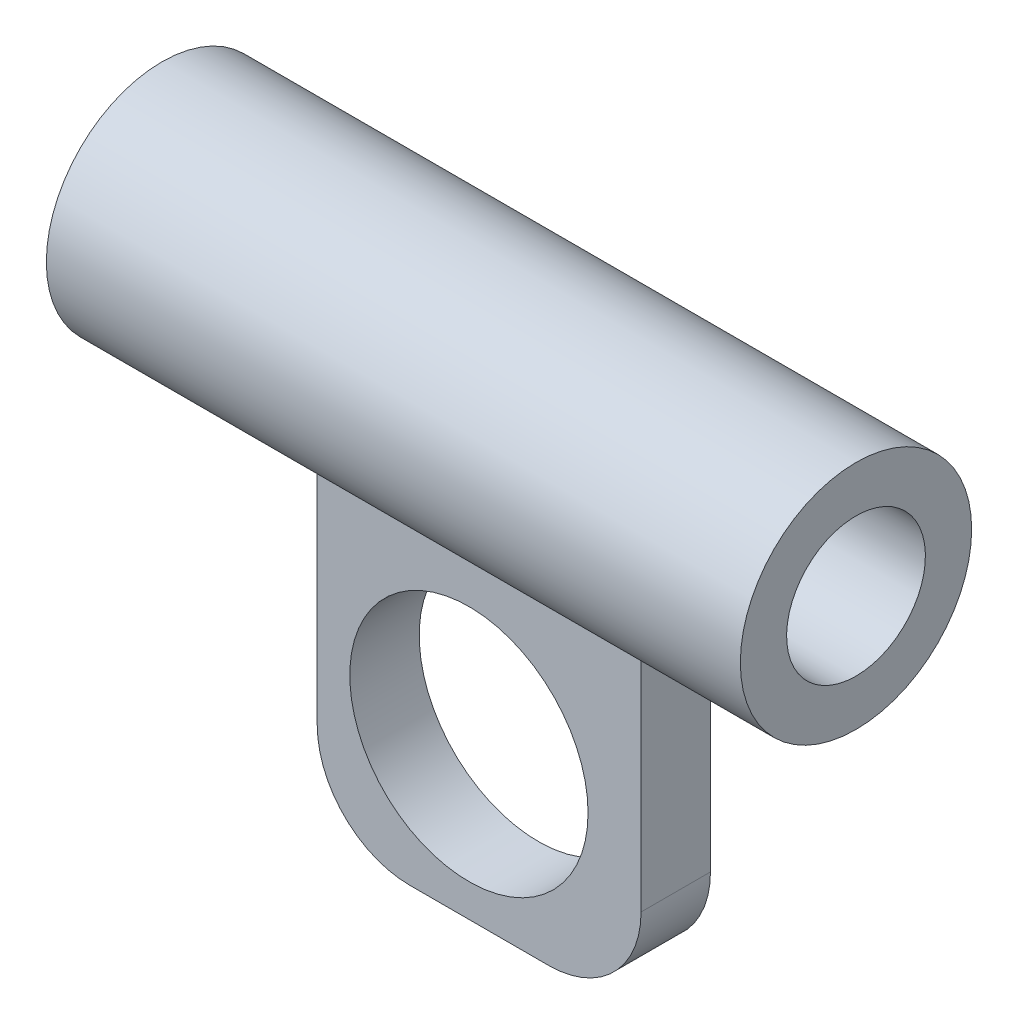
ISO-10303-21;
HEADER;
FILE_DESCRIPTION(('STEP AP214'),'2;1');
FILE_NAME('part.step','',(''),(''),'','','');
FILE_SCHEMA(('AUTOMOTIVE_DESIGN { 1 0 10303 214 1 1 1 1 }'));
ENDSEC;
DATA;
#1=APPLICATION_CONTEXT('core data for automotive mechanical design processes');
#2=APPLICATION_PROTOCOL_DEFINITION('international standard','automotive_design',2000,#1);
#3=PRODUCT_CONTEXT('',#1,'mechanical');
#4=PRODUCT('Part','Part','',(#3));
#5=PRODUCT_RELATED_PRODUCT_CATEGORY('part','',(#4));
#6=PRODUCT_DEFINITION_FORMATION('','',#4);
#7=PRODUCT_DEFINITION_CONTEXT('part definition',#1,'design');
#8=PRODUCT_DEFINITION('design','',#6,#7);
#9=PRODUCT_DEFINITION_SHAPE('','',#8);
#10=(LENGTH_UNIT() NAMED_UNIT(*) SI_UNIT(.MILLI.,.METRE.));
#11=(NAMED_UNIT(*) PLANE_ANGLE_UNIT() SI_UNIT($,.RADIAN.));
#12=(NAMED_UNIT(*) SI_UNIT($,.STERADIAN.) SOLID_ANGLE_UNIT());
#13=UNCERTAINTY_MEASURE_WITH_UNIT(LENGTH_MEASURE(1.E-05),#10,'distance_accuracy_value','');
#14=(GEOMETRIC_REPRESENTATION_CONTEXT(3) GLOBAL_UNCERTAINTY_ASSIGNED_CONTEXT((#13)) GLOBAL_UNIT_ASSIGNED_CONTEXT((#10,
#11,#12)) REPRESENTATION_CONTEXT('',''));
#15=CARTESIAN_POINT('',(0.,0.,0.));
#16=DIRECTION('',(0.,0.,1.));
#17=DIRECTION('',(1.,0.,0.));
#18=AXIS2_PLACEMENT_3D('',#15,#16,#17);
#19=CARTESIAN_POINT('',(4.,4.,3.));
#20=DIRECTION('',(0.,0.,-1.));
#21=DIRECTION('',(-1.,0.,0.));
#22=AXIS2_PLACEMENT_3D('',#19,#20,#21);
#23=PLANE('',#22);
#24=DIRECTION('',(0.,1.,0.));
#25=VECTOR('',#24,1.);
#26=CARTESIAN_POINT('',(14.,4.00000000000003,3.));
#27=LINE('',#26,#25);
#28=CARTESIAN_POINT('',(14.,4.,3.));
#29=VERTEX_POINT('',#28);
#30=CARTESIAN_POINT('',(14.,14.3540870917137,3.));
#31=VERTEX_POINT('',#30);
#32=EDGE_CURVE('E100',#29,#31,#27,.T.);
#33=ORIENTED_EDGE('',*,*,#32,.T.);
#34=DIRECTION('',(-1.,0.,0.));
#35=VECTOR('',#34,1.);
#36=CARTESIAN_POINT('',(22.,14.3540870917137,3.));
#37=LINE('',#36,#35);
#38=CARTESIAN_POINT('',(0.,14.3540870917137,3.));
#39=VERTEX_POINT('',#38);
#40=EDGE_CURVE('E95',#31,#39,#37,.T.);
#41=ORIENTED_EDGE('',*,*,#40,.T.);
#42=DIRECTION('',(0.,-1.,0.));
#43=VECTOR('',#42,1.);
#44=CARTESIAN_POINT('',(0.,4.00000000000003,3.));
#45=LINE('',#44,#43);
#46=CARTESIAN_POINT('',(0.,4.00000000000003,3.));
#47=VERTEX_POINT('',#46);
#48=EDGE_CURVE('E58',#39,#47,#45,.T.);
#49=ORIENTED_EDGE('',*,*,#48,.T.);
#50=CARTESIAN_POINT('',(4.,4.,3.));
#51=DIRECTION('',(0.,0.,1.));
#52=DIRECTION('',(-1.,0.,0.));
#53=AXIS2_PLACEMENT_3D('',#50,#51,#52);
#54=CIRCLE('',#53,4.);
#55=CARTESIAN_POINT('',(4.00000000000003,0.,3.));
#56=VERTEX_POINT('',#55);
#57=EDGE_CURVE('E124',#47,#56,#54,.T.);
#58=ORIENTED_EDGE('',*,*,#57,.T.);
#59=DIRECTION('',(1.,0.,0.));
#60=VECTOR('',#59,1.);
#61=CARTESIAN_POINT('',(4.00000000000003,0.,3.));
#62=LINE('',#61,#60);
#63=CARTESIAN_POINT('',(9.99999999999997,0.,3.));
#64=VERTEX_POINT('',#63);
#65=EDGE_CURVE('E87',#56,#64,#62,.T.);
#66=ORIENTED_EDGE('',*,*,#65,.T.);
#67=CARTESIAN_POINT('',(10.,4.,3.));
#68=DIRECTION('',(0.,0.,1.));
#69=DIRECTION('',(1.,0.,0.));
#70=AXIS2_PLACEMENT_3D('',#67,#68,#69);
#71=CIRCLE('',#70,4.);
#72=EDGE_CURVE('E109',#64,#29,#71,.T.);
#73=ORIENTED_EDGE('',*,*,#72,.T.);
#74=EDGE_LOOP('',(#33,#41,#49,#58,#66,#73));
#75=FACE_BOUND('',#74,.T.);
#76=CARTESIAN_POINT('',(6.55801035100123,6.56601198515732,3.));
#77=DIRECTION('',(0.,0.,1.));
#78=DIRECTION('',(1.,0.,0.));
#79=AXIS2_PLACEMENT_3D('',#76,#77,#78);
#80=CIRCLE('',#79,5.15);
#81=CARTESIAN_POINT('',(11.7080103510012,6.56601198515732,3.));
#82=VERTEX_POINT('',#81);
#83=EDGE_CURVE('E117',#82,#82,#80,.T.);
#84=ORIENTED_EDGE('',*,*,#83,.F.);
#85=EDGE_LOOP('',(#84));
#86=FACE_BOUND('',#85,.T.);
#87=ADVANCED_FACE('F35',(#75,#86),#23,.F.);
#88=CARTESIAN_POINT('',(4.,4.,0.));
#89=DIRECTION('',(0.,0.,-1.));
#90=DIRECTION('',(-1.,0.,0.));
#91=AXIS2_PLACEMENT_3D('',#88,#89,#90);
#92=PLANE('',#91);
#93=DIRECTION('',(-1.,0.,0.));
#94=VECTOR('',#93,1.);
#95=CARTESIAN_POINT('',(22.,14.4860551808923,0.));
#96=LINE('',#95,#94);
#97=CARTESIAN_POINT('',(14.,14.4860551808923,0.));
#98=VERTEX_POINT('',#97);
#99=CARTESIAN_POINT('',(0.,14.4860551808923,0.));
#100=VERTEX_POINT('',#99);
#101=EDGE_CURVE('E50',#98,#100,#96,.T.);
#102=ORIENTED_EDGE('',*,*,#101,.F.);
#103=DIRECTION('',(0.,1.,0.));
#104=VECTOR('',#103,1.);
#105=CARTESIAN_POINT('',(14.,4.00000000000003,0.));
#106=LINE('',#105,#104);
#107=CARTESIAN_POINT('',(14.,4.,0.));
#108=VERTEX_POINT('',#107);
#109=EDGE_CURVE('E121',#108,#98,#106,.T.);
#110=ORIENTED_EDGE('',*,*,#109,.F.);
#111=CARTESIAN_POINT('',(10.,4.,0.));
#112=DIRECTION('',(0.,0.,1.));
#113=DIRECTION('',(1.,0.,0.));
#114=AXIS2_PLACEMENT_3D('',#111,#112,#113);
#115=CIRCLE('',#114,4.);
#116=CARTESIAN_POINT('',(9.99999999999997,0.,0.));
#117=VERTEX_POINT('',#116);
#118=EDGE_CURVE('E119',#117,#108,#115,.T.);
#119=ORIENTED_EDGE('',*,*,#118,.F.);
#120=DIRECTION('',(1.,0.,0.));
#121=VECTOR('',#120,1.);
#122=CARTESIAN_POINT('',(4.00000000000003,0.,0.));
#123=LINE('',#122,#121);
#124=CARTESIAN_POINT('',(4.00000000000003,0.,0.));
#125=VERTEX_POINT('',#124);
#126=EDGE_CURVE('E116',#125,#117,#123,.T.);
#127=ORIENTED_EDGE('',*,*,#126,.F.);
#128=CARTESIAN_POINT('',(4.,4.,0.));
#129=DIRECTION('',(0.,0.,1.));
#130=DIRECTION('',(-1.,0.,0.));
#131=AXIS2_PLACEMENT_3D('',#128,#129,#130);
#132=CIRCLE('',#131,4.);
#133=CARTESIAN_POINT('',(0.,4.00000000000003,0.));
#134=VERTEX_POINT('',#133);
#135=EDGE_CURVE('E113',#134,#125,#132,.T.);
#136=ORIENTED_EDGE('',*,*,#135,.F.);
#137=DIRECTION('',(0.,-1.,0.));
#138=VECTOR('',#137,1.);
#139=CARTESIAN_POINT('',(0.,4.00000000000003,0.));
#140=LINE('',#139,#138);
#141=EDGE_CURVE('E79',#100,#134,#140,.T.);
#142=ORIENTED_EDGE('',*,*,#141,.F.);
#143=EDGE_LOOP('',(#102,#110,#119,#127,#136,#142));
#144=FACE_BOUND('',#143,.T.);
#145=CARTESIAN_POINT('',(6.55801035100123,6.56601198515732,0.));
#146=DIRECTION('',(0.,0.,1.));
#147=DIRECTION('',(1.,0.,0.));
#148=AXIS2_PLACEMENT_3D('',#145,#146,#147);
#149=CIRCLE('',#148,5.15);
#150=CARTESIAN_POINT('',(11.7080103510012,6.56601198515732,0.));
#151=VERTEX_POINT('',#150);
#152=EDGE_CURVE('E145',#151,#151,#149,.T.);
#153=ORIENTED_EDGE('',*,*,#152,.T.);
#154=EDGE_LOOP('',(#153));
#155=FACE_BOUND('',#154,.T.);
#156=ADVANCED_FACE('F135',(#144,#155),#92,.T.);
#157=CARTESIAN_POINT('',(4.,4.,3.));
#158=DIRECTION('',(0.,0.,-1.));
#159=DIRECTION('',(-1.,0.,0.));
#160=AXIS2_PLACEMENT_3D('',#157,#158,#159);
#161=CYLINDRICAL_SURFACE('',#160,4.);
#162=ORIENTED_EDGE('',*,*,#135,.T.);
#163=DIRECTION('',(0.,0.,-1.));
#164=VECTOR('',#163,1.);
#165=CARTESIAN_POINT('',(4.00000000000003,0.,3.));
#166=LINE('',#165,#164);
#167=EDGE_CURVE('E43',#56,#125,#166,.T.);
#168=ORIENTED_EDGE('',*,*,#167,.F.);
#169=ORIENTED_EDGE('',*,*,#57,.F.);
#170=DIRECTION('',(0.,0.,-1.));
#171=VECTOR('',#170,1.);
#172=CARTESIAN_POINT('',(0.,4.00000000000003,3.));
#173=LINE('',#172,#171);
#174=EDGE_CURVE('E104',#47,#134,#173,.T.);
#175=ORIENTED_EDGE('',*,*,#174,.T.);
#176=EDGE_LOOP('',(#162,#168,#169,#175));
#177=FACE_BOUND('',#176,.T.);
#178=ADVANCED_FACE('F37',(#177),#161,.T.);
#179=CARTESIAN_POINT('',(4.00000000000003,0.,3.));
#180=DIRECTION('',(0.,1.,0.));
#181=DIRECTION('',(0.,0.,1.));
#182=AXIS2_PLACEMENT_3D('',#179,#180,#181);
#183=PLANE('',#182);
#184=ORIENTED_EDGE('',*,*,#126,.T.);
#185=DIRECTION('',(0.,0.,-1.));
#186=VECTOR('',#185,1.);
#187=CARTESIAN_POINT('',(9.99999999999997,0.,3.));
#188=LINE('',#187,#186);
#189=EDGE_CURVE('E128',#64,#117,#188,.T.);
#190=ORIENTED_EDGE('',*,*,#189,.F.);
#191=ORIENTED_EDGE('',*,*,#65,.F.);
#192=ORIENTED_EDGE('',*,*,#167,.T.);
#193=EDGE_LOOP('',(#184,#190,#191,#192));
#194=FACE_BOUND('',#193,.T.);
#195=ADVANCED_FACE('F131',(#194),#183,.F.);
#196=CARTESIAN_POINT('',(10.,4.,3.));
#197=DIRECTION('',(0.,0.,-1.));
#198=DIRECTION('',(-1.,0.,0.));
#199=AXIS2_PLACEMENT_3D('',#196,#197,#198);
#200=CYLINDRICAL_SURFACE('',#199,4.);
#201=ORIENTED_EDGE('',*,*,#118,.T.);
#202=DIRECTION('',(0.,0.,-1.));
#203=VECTOR('',#202,1.);
#204=CARTESIAN_POINT('',(14.,4.,3.));
#205=LINE('',#204,#203);
#206=EDGE_CURVE('E107',#29,#108,#205,.T.);
#207=ORIENTED_EDGE('',*,*,#206,.F.);
#208=ORIENTED_EDGE('',*,*,#72,.F.);
#209=ORIENTED_EDGE('',*,*,#189,.T.);
#210=EDGE_LOOP('',(#201,#207,#208,#209));
#211=FACE_BOUND('',#210,.T.);
#212=ADVANCED_FACE('F141',(#211),#200,.T.);
#213=CARTESIAN_POINT('',(14.,4.00000000000003,3.));
#214=DIRECTION('',(-1.,0.,0.));
#215=DIRECTION('',(0.,-1.,0.));
#216=AXIS2_PLACEMENT_3D('',#213,#214,#215);
#217=PLANE('',#216);
#218=ORIENTED_EDGE('',*,*,#109,.T.);
#219=CARTESIAN_POINT('',(14.,19.1847030034538,1.70959312104912));
#220=DIRECTION('',(-1.,0.,0.));
#221=DIRECTION('',(0.,-1.,0.));
#222=AXIS2_PLACEMENT_3D('',#219,#220,#221);
#223=CIRCLE('',#222,5.);
#224=EDGE_CURVE('E101',#98,#31,#223,.T.);
#225=ORIENTED_EDGE('',*,*,#224,.T.);
#226=ORIENTED_EDGE('',*,*,#32,.F.);
#227=ORIENTED_EDGE('',*,*,#206,.T.);
#228=EDGE_LOOP('',(#218,#225,#226,#227));
#229=FACE_BOUND('',#228,.T.);
#230=ADVANCED_FACE('F144',(#229),#217,.F.);
#231=CARTESIAN_POINT('',(0.,4.00000000000003,3.));
#232=DIRECTION('',(1.,0.,0.));
#233=DIRECTION('',(0.,1.,0.));
#234=AXIS2_PLACEMENT_3D('',#231,#232,#233);
#235=PLANE('',#234);
#236=ORIENTED_EDGE('',*,*,#48,.F.);
#237=CARTESIAN_POINT('',(0.,19.1847030034538,1.70959312104912));
#238=DIRECTION('',(1.,0.,0.));
#239=DIRECTION('',(0.,1.,0.));
#240=AXIS2_PLACEMENT_3D('',#237,#238,#239);
#241=CIRCLE('',#240,5.);
#242=EDGE_CURVE('E11',#39,#100,#241,.T.);
#243=ORIENTED_EDGE('',*,*,#242,.T.);
#244=ORIENTED_EDGE('',*,*,#141,.T.);
#245=ORIENTED_EDGE('',*,*,#174,.F.);
#246=EDGE_LOOP('',(#236,#243,#244,#245));
#247=FACE_BOUND('',#246,.T.);
#248=ADVANCED_FACE('F103',(#247),#235,.F.);
#249=CARTESIAN_POINT('',(6.55801035100123,6.56601198515732,3.));
#250=DIRECTION('',(0.,0.,-1.));
#251=DIRECTION('',(-1.,0.,0.));
#252=AXIS2_PLACEMENT_3D('',#249,#250,#251);
#253=CYLINDRICAL_SURFACE('',#252,5.15);
#254=ORIENTED_EDGE('',*,*,#83,.T.);
#255=EDGE_LOOP('',(#254));
#256=FACE_BOUND('',#255,.T.);
#257=ORIENTED_EDGE('',*,*,#152,.F.);
#258=EDGE_LOOP('',(#257));
#259=FACE_BOUND('',#258,.T.);
#260=ADVANCED_FACE('F156',(#256,#259),#253,.F.);
#261=CARTESIAN_POINT('',(22.,19.1847030034538,1.70959312104912));
#262=DIRECTION('',(-1.,0.,0.));
#263=DIRECTION('',(0.,-1.,0.));
#264=AXIS2_PLACEMENT_3D('',#261,#262,#263);
#265=CYLINDRICAL_SURFACE('',#264,3.);
#266=CARTESIAN_POINT('',(22.,19.1847030034538,1.70959312104912));
#267=DIRECTION('',(-1.,0.,0.));
#268=DIRECTION('',(0.,-1.,0.));
#269=AXIS2_PLACEMENT_3D('',#266,#267,#268);
#270=CIRCLE('',#269,3.);
#271=CARTESIAN_POINT('',(22.,16.1847030034538,1.70959312104912));
#272=VERTEX_POINT('',#271);
#273=EDGE_CURVE('E263',#272,#272,#270,.T.);
#274=ORIENTED_EDGE('',*,*,#273,.F.);
#275=EDGE_LOOP('',(#274));
#276=FACE_BOUND('',#275,.T.);
#277=CARTESIAN_POINT('',(-8.,19.1847030034538,1.70959312104912));
#278=DIRECTION('',(-1.,0.,0.));
#279=DIRECTION('',(0.,-1.,0.));
#280=AXIS2_PLACEMENT_3D('',#277,#278,#279);
#281=CIRCLE('',#280,3.);
#282=CARTESIAN_POINT('',(-8.,16.1847030034538,1.70959312104912));
#283=VERTEX_POINT('',#282);
#284=EDGE_CURVE('E266',#283,#283,#281,.T.);
#285=ORIENTED_EDGE('',*,*,#284,.T.);
#286=EDGE_LOOP('',(#285));
#287=FACE_BOUND('',#286,.T.);
#288=ADVANCED_FACE('F210',(#276,#287),#265,.F.);
#289=CARTESIAN_POINT('',(22.,19.1847030034538,1.70959312104912));
#290=DIRECTION('',(-1.,0.,0.));
#291=DIRECTION('',(0.,-1.,0.));
#292=AXIS2_PLACEMENT_3D('',#289,#290,#291);
#293=CYLINDRICAL_SURFACE('',#292,5.);
#294=CARTESIAN_POINT('',(-8.,19.1847030034538,1.70959312104912));
#295=DIRECTION('',(-1.,0.,0.));
#296=DIRECTION('',(0.,-1.,0.));
#297=AXIS2_PLACEMENT_3D('',#294,#295,#296);
#298=CIRCLE('',#297,5.);
#299=CARTESIAN_POINT('',(-8.,14.1847030034538,1.70959312104912));
#300=VERTEX_POINT('',#299);
#301=EDGE_CURVE('E268',#300,#300,#298,.T.);
#302=ORIENTED_EDGE('',*,*,#301,.F.);
#303=EDGE_LOOP('',(#302));
#304=FACE_BOUND('',#303,.T.);
#305=CARTESIAN_POINT('',(22.,19.1847030034538,1.70959312104912));
#306=DIRECTION('',(-1.,0.,0.));
#307=DIRECTION('',(0.,-1.,0.));
#308=AXIS2_PLACEMENT_3D('',#305,#306,#307);
#309=CIRCLE('',#308,5.);
#310=CARTESIAN_POINT('',(22.,14.1847030034538,1.70959312104912));
#311=VERTEX_POINT('',#310);
#312=EDGE_CURVE('E274',#311,#311,#309,.T.);
#313=ORIENTED_EDGE('',*,*,#312,.T.);
#314=EDGE_LOOP('',(#313));
#315=FACE_BOUND('',#314,.T.);
#316=ORIENTED_EDGE('',*,*,#224,.F.);
#317=ORIENTED_EDGE('',*,*,#101,.T.);
#318=ORIENTED_EDGE('',*,*,#242,.F.);
#319=ORIENTED_EDGE('',*,*,#40,.F.);
#320=EDGE_LOOP('',(#316,#317,#318,#319));
#321=FACE_BOUND('',#320,.T.);
#322=ADVANCED_FACE('F94',(#304,#315,#321),#293,.T.);
#323=CARTESIAN_POINT('',(22.,19.1847030034538,1.70959312104912));
#324=DIRECTION('',(-1.,0.,0.));
#325=DIRECTION('',(0.,-1.,0.));
#326=AXIS2_PLACEMENT_3D('',#323,#324,#325);
#327=PLANE('',#326);
#328=ORIENTED_EDGE('',*,*,#273,.T.);
#329=EDGE_LOOP('',(#328));
#330=FACE_BOUND('',#329,.T.);
#331=ORIENTED_EDGE('',*,*,#312,.F.);
#332=EDGE_LOOP('',(#331));
#333=FACE_BOUND('',#332,.T.);
#334=ADVANCED_FACE('F209',(#330,#333),#327,.F.);
#335=CARTESIAN_POINT('',(-8.,19.1847030034538,1.70959312104912));
#336=DIRECTION('',(-1.,0.,0.));
#337=DIRECTION('',(0.,-1.,0.));
#338=AXIS2_PLACEMENT_3D('',#335,#336,#337);
#339=PLANE('',#338);
#340=ORIENTED_EDGE('',*,*,#301,.T.);
#341=EDGE_LOOP('',(#340));
#342=FACE_BOUND('',#341,.T.);
#343=ORIENTED_EDGE('',*,*,#284,.F.);
#344=EDGE_LOOP('',(#343));
#345=FACE_BOUND('',#344,.T.);
#346=ADVANCED_FACE('F221',(#342,#345),#339,.T.);
#347=CLOSED_SHELL('',(#87,#156,#178,#195,#212,#230,#248,#260,#288,#322,#334,#346));
#348=MANIFOLD_SOLID_BREP('B2',#347);
#349=ADVANCED_BREP_SHAPE_REPRESENTATION('',(#18,#348),#14);
#350=SHAPE_DEFINITION_REPRESENTATION(#9,#349);
ENDSEC;
END-ISO-10303-21;
